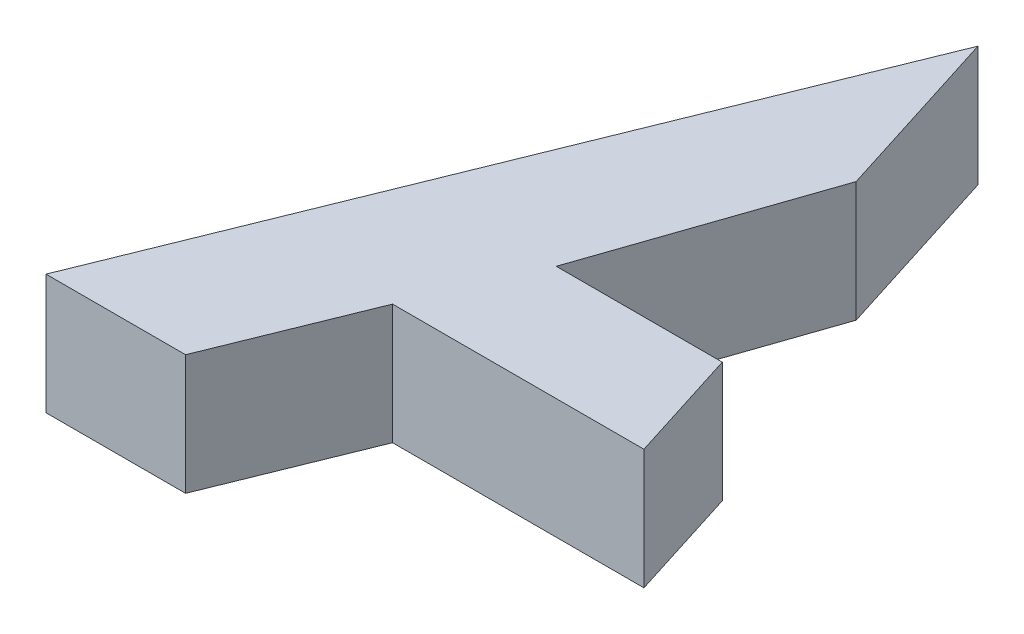
ISO-10303-21;
HEADER;
FILE_DESCRIPTION(('STEP AP214'),'2;1');
FILE_NAME('part.step','',(''),(''),'','','');
FILE_SCHEMA(('AUTOMOTIVE_DESIGN { 1 0 10303 214 1 1 1 1 }'));
ENDSEC;
DATA;
#1=APPLICATION_CONTEXT('core data for automotive mechanical design processes');
#2=APPLICATION_PROTOCOL_DEFINITION('international standard','automotive_design',2000,#1);
#3=PRODUCT_CONTEXT('',#1,'mechanical');
#4=PRODUCT('Part','Part','',(#3));
#5=PRODUCT_RELATED_PRODUCT_CATEGORY('part','',(#4));
#6=PRODUCT_DEFINITION_FORMATION('','',#4);
#7=PRODUCT_DEFINITION_CONTEXT('part definition',#1,'design');
#8=PRODUCT_DEFINITION('design','',#6,#7);
#9=PRODUCT_DEFINITION_SHAPE('','',#8);
#10=(LENGTH_UNIT() NAMED_UNIT(*) SI_UNIT(.MILLI.,.METRE.));
#11=(NAMED_UNIT(*) PLANE_ANGLE_UNIT() SI_UNIT($,.RADIAN.));
#12=(NAMED_UNIT(*) SI_UNIT($,.STERADIAN.) SOLID_ANGLE_UNIT());
#13=UNCERTAINTY_MEASURE_WITH_UNIT(LENGTH_MEASURE(1.E-05),#10,'distance_accuracy_value','');
#14=(GEOMETRIC_REPRESENTATION_CONTEXT(3) GLOBAL_UNCERTAINTY_ASSIGNED_CONTEXT((#13)) GLOBAL_UNIT_ASSIGNED_CONTEXT((#10,
#11,#12)) REPRESENTATION_CONTEXT('',''));
#15=CARTESIAN_POINT('',(0.,0.,0.));
#16=DIRECTION('',(0.,0.,1.));
#17=DIRECTION('',(1.,0.,0.));
#18=AXIS2_PLACEMENT_3D('',#15,#16,#17);
#19=CARTESIAN_POINT('',(105.073786331604,10.,-151.968262379523));
#20=DIRECTION('',(0.,0.,-1.));
#21=DIRECTION('',(-1.,0.,0.));
#22=AXIS2_PLACEMENT_3D('',#19,#20,#21);
#23=PLANE('',#22);
#24=DIRECTION('',(1.,0.,0.));
#25=VECTOR('',#24,1.);
#26=CARTESIAN_POINT('',(105.073786331604,0.,-151.968262379523));
#27=LINE('',#26,#25);
#28=CARTESIAN_POINT('',(105.073786331604,0.,-151.968262379523));
#29=VERTEX_POINT('',#28);
#30=CARTESIAN_POINT('',(116.699658449363,0.,-151.968262379523));
#31=VERTEX_POINT('',#30);
#32=EDGE_CURVE('E126',#29,#31,#27,.T.);
#33=ORIENTED_EDGE('',*,*,#32,.T.);
#34=DIRECTION('',(0.,-1.,0.));
#35=VECTOR('',#34,1.);
#36=CARTESIAN_POINT('',(116.699658449363,10.,-151.968262379523));
#37=LINE('',#36,#35);
#38=CARTESIAN_POINT('',(116.699658449363,10.,-151.968262379523));
#39=VERTEX_POINT('',#38);
#40=EDGE_CURVE('E11',#39,#31,#37,.T.);
#41=ORIENTED_EDGE('',*,*,#40,.F.);
#42=DIRECTION('',(1.,0.,0.));
#43=VECTOR('',#42,1.);
#44=CARTESIAN_POINT('',(105.073786331604,10.,-151.968262379523));
#45=LINE('',#44,#43);
#46=CARTESIAN_POINT('',(105.073786331604,10.,-151.968262379523));
#47=VERTEX_POINT('',#46);
#48=EDGE_CURVE('E140',#47,#39,#45,.T.);
#49=ORIENTED_EDGE('',*,*,#48,.F.);
#50=DIRECTION('',(0.,-1.,0.));
#51=VECTOR('',#50,1.);
#52=CARTESIAN_POINT('',(105.073786331604,10.,-151.968262379523));
#53=LINE('',#52,#51);
#54=EDGE_CURVE('E122',#47,#29,#53,.T.);
#55=ORIENTED_EDGE('',*,*,#54,.T.);
#56=EDGE_LOOP('',(#33,#41,#49,#55));
#57=FACE_BOUND('',#56,.T.);
#58=ADVANCED_FACE('F30',(#57),#23,.F.);
#59=CARTESIAN_POINT('',(116.699658449363,10.,-151.968262379523));
#60=DIRECTION('',(-0.926946813223158,0.,-0.375192757733184));
#61=DIRECTION('',(-0.375192757733184,0.,0.926946813223158));
#62=AXIS2_PLACEMENT_3D('',#59,#60,#61);
#63=PLANE('',#62);
#64=DIRECTION('',(0.375192757733184,0.,-0.926946813223158));
#65=VECTOR('',#64,1.);
#66=CARTESIAN_POINT('',(116.699658449363,0.,-151.968262379523));
#67=LINE('',#66,#65);
#68=CARTESIAN_POINT('',(121.666492689045,0.,-164.239264618737));
#69=VERTEX_POINT('',#68);
#70=EDGE_CURVE('E129',#31,#69,#67,.T.);
#71=ORIENTED_EDGE('',*,*,#70,.T.);
#72=DIRECTION('',(0.,-1.,0.));
#73=VECTOR('',#72,1.);
#74=CARTESIAN_POINT('',(121.666492689045,10.,-164.239264618737));
#75=LINE('',#74,#73);
#76=CARTESIAN_POINT('',(121.666492689045,10.,-164.239264618737));
#77=VERTEX_POINT('',#76);
#78=EDGE_CURVE('E38',#77,#69,#75,.T.);
#79=ORIENTED_EDGE('',*,*,#78,.F.);
#80=DIRECTION('',(0.375192757733184,0.,-0.926946813223158));
#81=VECTOR('',#80,1.);
#82=CARTESIAN_POINT('',(116.699658449363,10.,-151.968262379523));
#83=LINE('',#82,#81);
#84=EDGE_CURVE('E89',#39,#77,#83,.T.);
#85=ORIENTED_EDGE('',*,*,#84,.F.);
#86=ORIENTED_EDGE('',*,*,#40,.T.);
#87=EDGE_LOOP('',(#71,#79,#85,#86));
#88=FACE_BOUND('',#87,.T.);
#89=ADVANCED_FACE('F175',(#88),#63,.F.);
#90=CARTESIAN_POINT('',(121.666492689045,10.,-164.239264618737));
#91=DIRECTION('',(0.,0.,-1.));
#92=DIRECTION('',(-1.,0.,0.));
#93=AXIS2_PLACEMENT_3D('',#90,#91,#92);
#94=PLANE('',#93);
#95=DIRECTION('',(1.,0.,0.));
#96=VECTOR('',#95,1.);
#97=CARTESIAN_POINT('',(121.666492689045,0.,-164.239264618737));
#98=LINE('',#97,#96);
#99=CARTESIAN_POINT('',(142.605107621036,0.,-164.239264618737));
#100=VERTEX_POINT('',#99);
#101=EDGE_CURVE('E131',#69,#100,#98,.T.);
#102=ORIENTED_EDGE('',*,*,#101,.T.);
#103=DIRECTION('',(0.,-1.,0.));
#104=VECTOR('',#103,1.);
#105=CARTESIAN_POINT('',(142.605107621036,10.,-164.239264618737));
#106=LINE('',#105,#104);
#107=CARTESIAN_POINT('',(142.605107621036,10.,-164.239264618737));
#108=VERTEX_POINT('',#107);
#109=EDGE_CURVE('E147',#108,#100,#106,.T.);
#110=ORIENTED_EDGE('',*,*,#109,.F.);
#111=DIRECTION('',(1.,0.,0.));
#112=VECTOR('',#111,1.);
#113=CARTESIAN_POINT('',(121.666492689045,10.,-164.239264618737));
#114=LINE('',#113,#112);
#115=EDGE_CURVE('E155',#77,#108,#114,.T.);
#116=ORIENTED_EDGE('',*,*,#115,.F.);
#117=ORIENTED_EDGE('',*,*,#78,.T.);
#118=EDGE_LOOP('',(#102,#110,#116,#117));
#119=FACE_BOUND('',#118,.T.);
#120=ADVANCED_FACE('F153',(#119),#94,.F.);
#121=CARTESIAN_POINT('',(142.605107621036,10.,-164.239264618737));
#122=DIRECTION('',(-0.953435514675028,0.,0.30159694851965));
#123=DIRECTION('',(0.30159694851965,0.,0.953435514675028));
#124=AXIS2_PLACEMENT_3D('',#121,#122,#123);
#125=PLANE('',#124);
#126=DIRECTION('',(-0.30159694851965,0.,-0.953435514675028));
#127=VECTOR('',#126,1.);
#128=CARTESIAN_POINT('',(142.605107621036,0.,-164.239264618737));
#129=LINE('',#128,#127);
#130=CARTESIAN_POINT('',(139.586051514563,0.,-173.783377471458));
#131=VERTEX_POINT('',#130);
#132=EDGE_CURVE('E133',#100,#131,#129,.T.);
#133=ORIENTED_EDGE('',*,*,#132,.T.);
#134=DIRECTION('',(0.,-1.,0.));
#135=VECTOR('',#134,1.);
#136=CARTESIAN_POINT('',(139.586051514563,10.,-173.783377471458));
#137=LINE('',#136,#135);
#138=CARTESIAN_POINT('',(139.586051514563,10.,-173.783377471458));
#139=VERTEX_POINT('',#138);
#140=EDGE_CURVE('E144',#139,#131,#137,.T.);
#141=ORIENTED_EDGE('',*,*,#140,.F.);
#142=DIRECTION('',(-0.30159694851965,0.,-0.953435514675028));
#143=VECTOR('',#142,1.);
#144=CARTESIAN_POINT('',(142.605107621036,10.,-164.239264618737));
#145=LINE('',#144,#143);
#146=EDGE_CURVE('E167',#108,#139,#145,.T.);
#147=ORIENTED_EDGE('',*,*,#146,.F.);
#148=ORIENTED_EDGE('',*,*,#109,.T.);
#149=EDGE_LOOP('',(#133,#141,#147,#148));
#150=FACE_BOUND('',#149,.T.);
#151=ADVANCED_FACE('F163',(#150),#125,.F.);
#152=CARTESIAN_POINT('',(139.586051514563,10.,-173.783377471458));
#153=DIRECTION('',(0.,0.,1.));
#154=DIRECTION('',(1.,0.,0.));
#155=AXIS2_PLACEMENT_3D('',#152,#153,#154);
#156=PLANE('',#155);
#157=DIRECTION('',(-1.,0.,0.));
#158=VECTOR('',#157,1.);
#159=CARTESIAN_POINT('',(139.586051514563,0.,-173.783377471458));
#160=LINE('',#159,#158);
#161=CARTESIAN_POINT('',(125.756826768783,0.,-173.783377471458));
#162=VERTEX_POINT('',#161);
#163=EDGE_CURVE('E135',#131,#162,#160,.T.);
#164=ORIENTED_EDGE('',*,*,#163,.T.);
#165=DIRECTION('',(0.,-1.,0.));
#166=VECTOR('',#165,1.);
#167=CARTESIAN_POINT('',(125.756826768783,10.,-173.783377471458));
#168=LINE('',#167,#166);
#169=CARTESIAN_POINT('',(125.756826768783,10.,-173.783377471458));
#170=VERTEX_POINT('',#169);
#171=EDGE_CURVE('E117',#170,#162,#168,.T.);
#172=ORIENTED_EDGE('',*,*,#171,.F.);
#173=DIRECTION('',(-1.,0.,0.));
#174=VECTOR('',#173,1.);
#175=CARTESIAN_POINT('',(139.586051514563,10.,-173.783377471458));
#176=LINE('',#175,#174);
#177=EDGE_CURVE('E108',#139,#170,#176,.T.);
#178=ORIENTED_EDGE('',*,*,#177,.F.);
#179=ORIENTED_EDGE('',*,*,#140,.T.);
#180=EDGE_LOOP('',(#164,#172,#178,#179));
#181=FACE_BOUND('',#180,.T.);
#182=ADVANCED_FACE('F166',(#181),#156,.F.);
#183=CARTESIAN_POINT('',(125.756826768783,10.,-173.783377471458));
#184=DIRECTION('',(-0.945924238277794,0.,-0.324387631451285));
#185=DIRECTION('',(-0.324387631451285,0.,0.945924238277794));
#186=AXIS2_PLACEMENT_3D('',#183,#184,#185);
#187=PLANE('',#186);
#188=DIRECTION('',(0.324387631451285,0.,-0.945924238277794));
#189=VECTOR('',#188,1.);
#190=CARTESIAN_POINT('',(125.756826768783,0.,-173.783377471458));
#191=LINE('',#190,#189);
#192=CARTESIAN_POINT('',(132.13580015504,0.,-192.3846586436));
#193=VERTEX_POINT('',#192);
#194=EDGE_CURVE('E116',#162,#193,#191,.T.);
#195=ORIENTED_EDGE('',*,*,#194,.T.);
#196=DIRECTION('',(0.,-1.,0.));
#197=VECTOR('',#196,1.);
#198=CARTESIAN_POINT('',(132.13580015504,10.,-192.3846586436));
#199=LINE('',#198,#197);
#200=CARTESIAN_POINT('',(132.13580015504,10.,-192.3846586436));
#201=VERTEX_POINT('',#200);
#202=EDGE_CURVE('E113',#201,#193,#199,.T.);
#203=ORIENTED_EDGE('',*,*,#202,.F.);
#204=DIRECTION('',(0.324387631451285,0.,-0.945924238277794));
#205=VECTOR('',#204,1.);
#206=CARTESIAN_POINT('',(125.756826768783,10.,-173.783377471458));
#207=LINE('',#206,#205);
#208=EDGE_CURVE('E102',#170,#201,#207,.T.);
#209=ORIENTED_EDGE('',*,*,#208,.F.);
#210=ORIENTED_EDGE('',*,*,#171,.T.);
#211=EDGE_LOOP('',(#195,#203,#209,#210));
#212=FACE_BOUND('',#211,.T.);
#213=ADVANCED_FACE('F114',(#212),#187,.F.);
#214=CARTESIAN_POINT('',(132.13580015504,10.,-192.3846586436));
#215=DIRECTION('',(-0.953435514675028,0.,0.30159694851965));
#216=DIRECTION('',(0.30159694851965,0.,0.953435514675028));
#217=AXIS2_PLACEMENT_3D('',#214,#215,#216);
#218=PLANE('',#217);
#219=DIRECTION('',(-0.30159694851965,0.,-0.953435514675028));
#220=VECTOR('',#219,1.);
#221=CARTESIAN_POINT('',(132.13580015504,0.,-192.3846586436));
#222=LINE('',#221,#220);
#223=CARTESIAN_POINT('',(127.440617821164,0.,-207.227493118435));
#224=VERTEX_POINT('',#223);
#225=EDGE_CURVE('E75',#193,#224,#222,.T.);
#226=ORIENTED_EDGE('',*,*,#225,.T.);
#227=DIRECTION('',(0.,-1.,0.));
#228=VECTOR('',#227,1.);
#229=CARTESIAN_POINT('',(127.440617821164,10.,-207.227493118435));
#230=LINE('',#229,#228);
#231=CARTESIAN_POINT('',(127.440617821164,10.,-207.227493118435));
#232=VERTEX_POINT('',#231);
#233=EDGE_CURVE('E118',#232,#224,#230,.T.);
#234=ORIENTED_EDGE('',*,*,#233,.F.);
#235=DIRECTION('',(-0.30159694851965,0.,-0.953435514675028));
#236=VECTOR('',#235,1.);
#237=CARTESIAN_POINT('',(132.13580015504,10.,-192.3846586436));
#238=LINE('',#237,#236);
#239=EDGE_CURVE('E106',#201,#232,#238,.T.);
#240=ORIENTED_EDGE('',*,*,#239,.F.);
#241=ORIENTED_EDGE('',*,*,#202,.T.);
#242=EDGE_LOOP('',(#226,#234,#240,#241));
#243=FACE_BOUND('',#242,.T.);
#244=ADVANCED_FACE('F120',(#243),#218,.F.);
#245=CARTESIAN_POINT('',(127.440617821164,10.,-207.227493118435));
#246=DIRECTION('',(0.926946813223158,0.,0.375192757733184));
#247=DIRECTION('',(0.375192757733184,0.,-0.926946813223158));
#248=AXIS2_PLACEMENT_3D('',#245,#246,#247);
#249=PLANE('',#248);
#250=DIRECTION('',(-0.375192757733184,0.,0.926946813223158));
#251=VECTOR('',#250,1.);
#252=CARTESIAN_POINT('',(127.440617821164,0.,-207.227493118435));
#253=LINE('',#252,#251);
#254=EDGE_CURVE('E81',#224,#29,#253,.T.);
#255=ORIENTED_EDGE('',*,*,#254,.T.);
#256=ORIENTED_EDGE('',*,*,#54,.F.);
#257=DIRECTION('',(-0.375192757733184,0.,0.926946813223158));
#258=VECTOR('',#257,1.);
#259=CARTESIAN_POINT('',(127.440617821164,10.,-207.227493118435));
#260=LINE('',#259,#258);
#261=EDGE_CURVE('E46',#232,#47,#260,.T.);
#262=ORIENTED_EDGE('',*,*,#261,.F.);
#263=ORIENTED_EDGE('',*,*,#233,.T.);
#264=EDGE_LOOP('',(#255,#256,#262,#263));
#265=FACE_BOUND('',#264,.T.);
#266=ADVANCED_FACE('F191',(#265),#249,.F.);
#267=CARTESIAN_POINT('',(0.,10.,0.));
#268=DIRECTION('',(0.,1.,0.));
#269=DIRECTION('',(0.,0.,1.));
#270=AXIS2_PLACEMENT_3D('',#267,#268,#269);
#271=PLANE('',#270);
#272=ORIENTED_EDGE('',*,*,#48,.T.);
#273=ORIENTED_EDGE('',*,*,#84,.T.);
#274=ORIENTED_EDGE('',*,*,#115,.T.);
#275=ORIENTED_EDGE('',*,*,#146,.T.);
#276=ORIENTED_EDGE('',*,*,#177,.T.);
#277=ORIENTED_EDGE('',*,*,#208,.T.);
#278=ORIENTED_EDGE('',*,*,#239,.T.);
#279=ORIENTED_EDGE('',*,*,#261,.T.);
#280=EDGE_LOOP('',(#272,#273,#274,#275,#276,#277,#278,#279));
#281=FACE_BOUND('',#280,.T.);
#282=ADVANCED_FACE('F104',(#281),#271,.T.);
#283=CARTESIAN_POINT('',(0.,0.,0.));
#284=DIRECTION('',(0.,1.,0.));
#285=DIRECTION('',(0.,0.,1.));
#286=AXIS2_PLACEMENT_3D('',#283,#284,#285);
#287=PLANE('',#286);
#288=ORIENTED_EDGE('',*,*,#32,.F.);
#289=ORIENTED_EDGE('',*,*,#254,.F.);
#290=ORIENTED_EDGE('',*,*,#225,.F.);
#291=ORIENTED_EDGE('',*,*,#194,.F.);
#292=ORIENTED_EDGE('',*,*,#163,.F.);
#293=ORIENTED_EDGE('',*,*,#132,.F.);
#294=ORIENTED_EDGE('',*,*,#101,.F.);
#295=ORIENTED_EDGE('',*,*,#70,.F.);
#296=EDGE_LOOP('',(#288,#289,#290,#291,#292,#293,#294,#295));
#297=FACE_BOUND('',#296,.T.);
#298=ADVANCED_FACE('F159',(#297),#287,.F.);
#299=CLOSED_SHELL('',(#58,#89,#120,#151,#182,#213,#244,#266,#282,#298));
#300=MANIFOLD_SOLID_BREP('B2',#299);
#301=ADVANCED_BREP_SHAPE_REPRESENTATION('',(#18,#300),#14);
#302=SHAPE_DEFINITION_REPRESENTATION(#9,#301);
ENDSEC;
END-ISO-10303-21;
